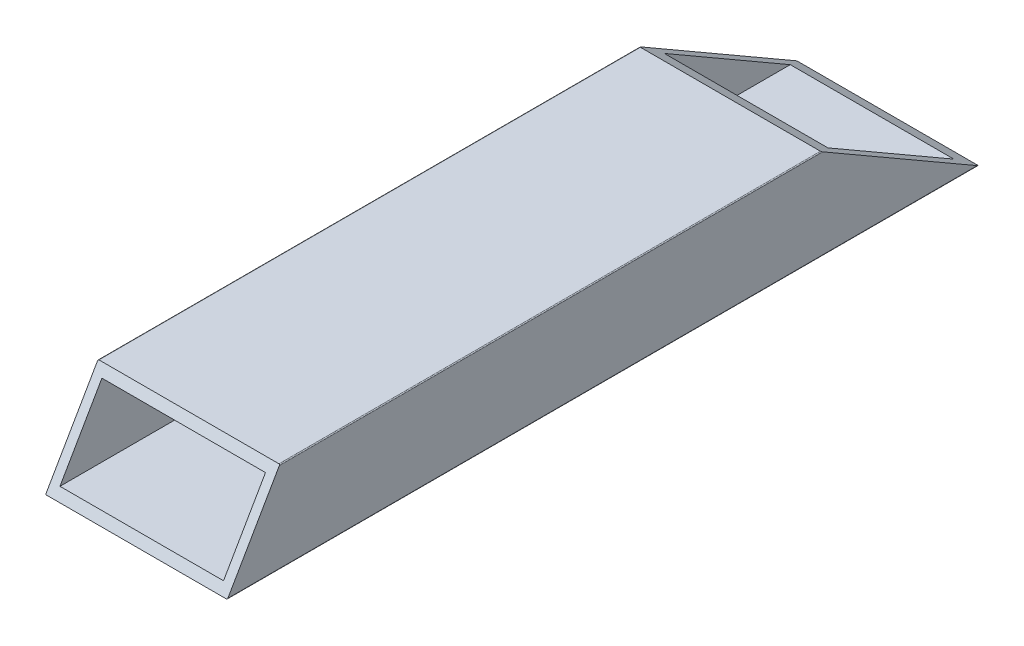
ISO-10303-21;
HEADER;
FILE_DESCRIPTION(('STEP AP214'),'2;1');
FILE_NAME('part.step','',(''),(''),'','','');
FILE_SCHEMA(('AUTOMOTIVE_DESIGN { 1 0 10303 214 1 1 1 1 }'));
ENDSEC;
DATA;
#1=APPLICATION_CONTEXT('core data for automotive mechanical design processes');
#2=APPLICATION_PROTOCOL_DEFINITION('international standard','automotive_design',2000,#1);
#3=PRODUCT_CONTEXT('',#1,'mechanical');
#4=PRODUCT('Part','Part','',(#3));
#5=PRODUCT_RELATED_PRODUCT_CATEGORY('part','',(#4));
#6=PRODUCT_DEFINITION_FORMATION('','',#4);
#7=PRODUCT_DEFINITION_CONTEXT('part definition',#1,'design');
#8=PRODUCT_DEFINITION('design','',#6,#7);
#9=PRODUCT_DEFINITION_SHAPE('','',#8);
#10=(LENGTH_UNIT() NAMED_UNIT(*) SI_UNIT(.MILLI.,.METRE.));
#11=(NAMED_UNIT(*) PLANE_ANGLE_UNIT() SI_UNIT($,.RADIAN.));
#12=(NAMED_UNIT(*) SI_UNIT($,.STERADIAN.) SOLID_ANGLE_UNIT());
#13=UNCERTAINTY_MEASURE_WITH_UNIT(LENGTH_MEASURE(1.E-05),#10,'distance_accuracy_value','');
#14=(GEOMETRIC_REPRESENTATION_CONTEXT(3) GLOBAL_UNCERTAINTY_ASSIGNED_CONTEXT((#13)) GLOBAL_UNIT_ASSIGNED_CONTEXT((#10,
#11,#12)) REPRESENTATION_CONTEXT('',''));
#15=CARTESIAN_POINT('',(0.,0.,0.));
#16=DIRECTION('',(0.,0.,1.));
#17=DIRECTION('',(1.,0.,0.));
#18=AXIS2_PLACEMENT_3D('',#15,#16,#17);
#19=CARTESIAN_POINT('',(2.,18.,165.35));
#20=DIRECTION('',(0.,-1.,0.));
#21=DIRECTION('',(0.,0.,-1.));
#22=AXIS2_PLACEMENT_3D('',#19,#20,#21);
#23=PLANE('',#22);
#24=DIRECTION('',(1.,0.,0.));
#25=VECTOR('',#24,1.);
#26=CARTESIAN_POINT('',(2.,18.,154.957695154587));
#27=LINE('',#26,#25);
#28=CARTESIAN_POINT('',(2.,18.,154.957695154587));
#29=VERTEX_POINT('',#28);
#30=CARTESIAN_POINT('',(38.,18.,154.957695154587));
#31=VERTEX_POINT('',#30);
#32=EDGE_CURVE('E11',#29,#31,#27,.T.);
#33=ORIENTED_EDGE('',*,*,#32,.F.);
#34=DIRECTION('',(0.,0.,-1.));
#35=VECTOR('',#34,1.);
#36=CARTESIAN_POINT('',(2.,18.,165.35));
#37=LINE('',#36,#35);
#38=CARTESIAN_POINT('',(2.,18.,31.1769145362402));
#39=VERTEX_POINT('',#38);
#40=EDGE_CURVE('E170',#29,#39,#37,.T.);
#41=ORIENTED_EDGE('',*,*,#40,.T.);
#42=DIRECTION('',(-1.,0.,0.));
#43=VECTOR('',#42,1.);
#44=CARTESIAN_POINT('',(1.99999999999992,18.,31.1769145362402));
#45=LINE('',#44,#43);
#46=CARTESIAN_POINT('',(38.,18.,31.1769145362402));
#47=VERTEX_POINT('',#46);
#48=EDGE_CURVE('E44',#47,#39,#45,.T.);
#49=ORIENTED_EDGE('',*,*,#48,.F.);
#50=DIRECTION('',(0.,0.,-1.));
#51=VECTOR('',#50,1.);
#52=CARTESIAN_POINT('',(38.,18.,165.35));
#53=LINE('',#52,#51);
#54=EDGE_CURVE('E176',#31,#47,#53,.T.);
#55=ORIENTED_EDGE('',*,*,#54,.F.);
#56=EDGE_LOOP('',(#33,#41,#49,#55));
#57=FACE_BOUND('',#56,.T.);
#58=ADVANCED_FACE('F36',(#57),#23,.T.);
#59=CARTESIAN_POINT('',(38.,2.,165.35));
#60=DIRECTION('',(-1.,0.,0.));
#61=DIRECTION('',(0.,0.,1.));
#62=AXIS2_PLACEMENT_3D('',#59,#60,#61);
#63=PLANE('',#62);
#64=DIRECTION('',(0.,-0.866025403784436,0.500000000000004));
#65=VECTOR('',#64,1.);
#66=CARTESIAN_POINT('',(38.,1.5,164.483974596216));
#67=LINE('',#66,#65);
#68=CARTESIAN_POINT('',(38.,2.,164.195299461621));
#69=VERTEX_POINT('',#68);
#70=EDGE_CURVE('E229',#31,#69,#67,.T.);
#71=ORIENTED_EDGE('',*,*,#70,.F.);
#72=ORIENTED_EDGE('',*,*,#54,.T.);
#73=DIRECTION('',(0.,0.499999999999995,0.866025403784442));
#74=VECTOR('',#73,1.);
#75=CARTESIAN_POINT('',(38.,72.098650257878,124.878525403785));
#76=LINE('',#75,#74);
#77=CARTESIAN_POINT('',(38.,2.,3.46410161513773));
#78=VERTEX_POINT('',#77);
#79=EDGE_CURVE('E160',#78,#47,#76,.T.);
#80=ORIENTED_EDGE('',*,*,#79,.F.);
#81=DIRECTION('',(0.,0.,-1.));
#82=VECTOR('',#81,1.);
#83=CARTESIAN_POINT('',(38.,2.,165.35));
#84=LINE('',#83,#82);
#85=EDGE_CURVE('E179',#69,#78,#84,.T.);
#86=ORIENTED_EDGE('',*,*,#85,.F.);
#87=EDGE_LOOP('',(#71,#72,#80,#86));
#88=FACE_BOUND('',#87,.T.);
#89=ADVANCED_FACE('F257',(#88),#63,.T.);
#90=CARTESIAN_POINT('',(2.,2.,165.35));
#91=DIRECTION('',(0.,1.,0.));
#92=DIRECTION('',(0.,0.,1.));
#93=AXIS2_PLACEMENT_3D('',#90,#91,#92);
#94=PLANE('',#93);
#95=DIRECTION('',(-1.,0.,0.));
#96=VECTOR('',#95,1.);
#97=CARTESIAN_POINT('',(2.,2.,164.195299461621));
#98=LINE('',#97,#96);
#99=CARTESIAN_POINT('',(2.,2.,164.195299461621));
#100=VERTEX_POINT('',#99);
#101=EDGE_CURVE('E231',#69,#100,#98,.T.);
#102=ORIENTED_EDGE('',*,*,#101,.F.);
#103=ORIENTED_EDGE('',*,*,#85,.T.);
#104=DIRECTION('',(1.,0.,0.));
#105=VECTOR('',#104,1.);
#106=CARTESIAN_POINT('',(1.9999999999999,2.,3.46410161513777));
#107=LINE('',#106,#105);
#108=CARTESIAN_POINT('',(2.,2.,3.46410161513777));
#109=VERTEX_POINT('',#108);
#110=EDGE_CURVE('E173',#109,#78,#107,.T.);
#111=ORIENTED_EDGE('',*,*,#110,.F.);
#112=DIRECTION('',(0.,0.,-1.));
#113=VECTOR('',#112,1.);
#114=CARTESIAN_POINT('',(2.,2.,165.35));
#115=LINE('',#114,#113);
#116=EDGE_CURVE('E143',#100,#109,#115,.T.);
#117=ORIENTED_EDGE('',*,*,#116,.F.);
#118=EDGE_LOOP('',(#102,#103,#111,#117));
#119=FACE_BOUND('',#118,.T.);
#120=ADVANCED_FACE('F262',(#119),#94,.T.);
#121=CARTESIAN_POINT('',(2.,2.,165.35));
#122=DIRECTION('',(1.,0.,0.));
#123=DIRECTION('',(0.,0.,-1.));
#124=AXIS2_PLACEMENT_3D('',#121,#122,#123);
#125=PLANE('',#124);
#126=DIRECTION('',(0.,0.866025403784436,-0.500000000000004));
#127=VECTOR('',#126,1.);
#128=CARTESIAN_POINT('',(2.,1.49999999999999,164.483974596216));
#129=LINE('',#128,#127);
#130=EDGE_CURVE('E233',#100,#29,#129,.T.);
#131=ORIENTED_EDGE('',*,*,#130,.F.);
#132=ORIENTED_EDGE('',*,*,#116,.T.);
#133=DIRECTION('',(0.,-0.499999999999995,-0.866025403784442));
#134=VECTOR('',#133,1.);
#135=CARTESIAN_POINT('',(2.,72.098650257878,124.878525403785));
#136=LINE('',#135,#134);
#137=EDGE_CURVE('E157',#39,#109,#136,.T.);
#138=ORIENTED_EDGE('',*,*,#137,.F.);
#139=ORIENTED_EDGE('',*,*,#40,.F.);
#140=EDGE_LOOP('',(#131,#132,#138,#139));
#141=FACE_BOUND('',#140,.T.);
#142=ADVANCED_FACE('F169',(#141),#125,.T.);
#143=CARTESIAN_POINT('',(40.,20.,34.641016151378));
#144=DIRECTION('',(0.,-0.866025403784442,0.499999999999995));
#145=DIRECTION('',(0.,-0.499999999999995,-0.866025403784442));
#146=AXIS2_PLACEMENT_3D('',#143,#144,#145);
#147=PLANE('',#146);
#148=ORIENTED_EDGE('',*,*,#137,.T.);
#149=ORIENTED_EDGE('',*,*,#110,.T.);
#150=ORIENTED_EDGE('',*,*,#79,.T.);
#151=ORIENTED_EDGE('',*,*,#48,.T.);
#152=EDGE_LOOP('',(#148,#149,#150,#151));
#153=FACE_BOUND('',#152,.T.);
#154=DIRECTION('',(0.,0.499999999999995,0.866025403784441));
#155=VECTOR('',#154,1.);
#156=CARTESIAN_POINT('',(0.,20.,34.641016151378));
#157=LINE('',#156,#155);
#158=CARTESIAN_POINT('',(0.,0.20000000000001,0.346410161513773));
#159=VERTEX_POINT('',#158);
#160=CARTESIAN_POINT('',(0.,19.8,34.2946059898642));
#161=VERTEX_POINT('',#160);
#162=EDGE_CURVE('E213',#159,#161,#157,.T.);
#163=ORIENTED_EDGE('',*,*,#162,.T.);
#164=CARTESIAN_POINT('',(0.2,19.8,34.2946059898642));
#165=DIRECTION('',(0.,-0.866025403784442,0.499999999999995));
#166=DIRECTION('',(0.,-0.499999999999995,-0.866025403784442));
#167=AXIS2_PLACEMENT_3D('',#164,#165,#166);
#168=ELLIPSE('',#167,0.400000000000003,0.199999999999999);
#169=CARTESIAN_POINT('',(0.199999999999999,20.,34.641016151378));
#170=VERTEX_POINT('',#169);
#171=EDGE_CURVE('E172',#170,#161,#168,.T.);
#172=ORIENTED_EDGE('',*,*,#171,.F.);
#173=DIRECTION('',(-1.,0.,0.));
#174=VECTOR('',#173,1.);
#175=CARTESIAN_POINT('',(40.,20.,34.641016151378));
#176=LINE('',#175,#174);
#177=CARTESIAN_POINT('',(39.8,20.,34.641016151378));
#178=VERTEX_POINT('',#177);
#179=EDGE_CURVE('E212',#178,#170,#176,.T.);
#180=ORIENTED_EDGE('',*,*,#179,.F.);
#181=CARTESIAN_POINT('',(39.8,19.8,34.2946059898642));
#182=DIRECTION('',(0.,-0.866025403784442,0.499999999999995));
#183=DIRECTION('',(0.,-0.499999999999995,-0.866025403784442));
#184=AXIS2_PLACEMENT_3D('',#181,#182,#183);
#185=ELLIPSE('',#184,0.400000000000001,0.199999999999999);
#186=CARTESIAN_POINT('',(40.,19.8,34.2946059898642));
#187=VERTEX_POINT('',#186);
#188=EDGE_CURVE('E132',#187,#178,#185,.T.);
#189=ORIENTED_EDGE('',*,*,#188,.F.);
#190=DIRECTION('',(0.,0.499999999999995,0.866025403784441));
#191=VECTOR('',#190,1.);
#192=CARTESIAN_POINT('',(40.,20.,34.641016151378));
#193=LINE('',#192,#191);
#194=CARTESIAN_POINT('',(40.,0.199999999999975,0.346410161513717));
#195=VERTEX_POINT('',#194);
#196=EDGE_CURVE('E127',#195,#187,#193,.T.);
#197=ORIENTED_EDGE('',*,*,#196,.F.);
#198=CARTESIAN_POINT('',(39.8,0.2,0.346410161513738));
#199=DIRECTION('',(0.,-0.866025403784442,0.499999999999995));
#200=DIRECTION('',(0.,-0.499999999999995,-0.866025403784442));
#201=AXIS2_PLACEMENT_3D('',#198,#199,#200);
#202=ELLIPSE('',#201,0.400000000000003,0.199999999999999);
#203=CARTESIAN_POINT('',(39.8,0.,0.));
#204=VERTEX_POINT('',#203);
#205=EDGE_CURVE('E122',#204,#195,#202,.T.);
#206=ORIENTED_EDGE('',*,*,#205,.F.);
#207=DIRECTION('',(1.,0.,0.));
#208=VECTOR('',#207,1.);
#209=CARTESIAN_POINT('',(0.200000000000001,0.,0.));
#210=LINE('',#209,#208);
#211=CARTESIAN_POINT('',(0.199999999999999,0.,0.));
#212=VERTEX_POINT('',#211);
#213=EDGE_CURVE('E125',#212,#204,#210,.T.);
#214=ORIENTED_EDGE('',*,*,#213,.F.);
#215=CARTESIAN_POINT('',(0.2,0.2,0.346410161513766));
#216=DIRECTION('',(0.,-0.866025403784442,0.499999999999995));
#217=DIRECTION('',(0.,-0.499999999999995,-0.866025403784442));
#218=AXIS2_PLACEMENT_3D('',#215,#216,#217);
#219=ELLIPSE('',#218,0.400000000000004,0.2);
#220=EDGE_CURVE('E59',#159,#212,#219,.T.);
#221=ORIENTED_EDGE('',*,*,#220,.F.);
#222=EDGE_LOOP('',(#163,#172,#180,#189,#197,#206,#214,#221));
#223=FACE_BOUND('',#222,.T.);
#224=ADVANCED_FACE('F124',(#153,#223),#147,.F.);
#225=CARTESIAN_POINT('',(40.,0.,165.35));
#226=DIRECTION('',(0.,-0.500000000000004,-0.866025403784436));
#227=DIRECTION('',(0.,0.866025403784436,-0.500000000000004));
#228=AXIS2_PLACEMENT_3D('',#225,#226,#227);
#229=PLANE('',#228);
#230=ORIENTED_EDGE('',*,*,#130,.T.);
#231=ORIENTED_EDGE('',*,*,#32,.T.);
#232=ORIENTED_EDGE('',*,*,#70,.T.);
#233=ORIENTED_EDGE('',*,*,#101,.T.);
#234=EDGE_LOOP('',(#230,#231,#232,#233));
#235=FACE_BOUND('',#234,.T.);
#236=DIRECTION('',(1.,0.,0.));
#237=VECTOR('',#236,1.);
#238=CARTESIAN_POINT('',(0.200000000000001,0.,165.35));
#239=LINE('',#238,#237);
#240=CARTESIAN_POINT('',(0.199999999999999,0.,165.35));
#241=VERTEX_POINT('',#240);
#242=CARTESIAN_POINT('',(39.8,0.,165.35));
#243=VERTEX_POINT('',#242);
#244=EDGE_CURVE('E142',#241,#243,#239,.T.);
#245=ORIENTED_EDGE('',*,*,#244,.T.);
#246=CARTESIAN_POINT('',(39.8,0.2,165.234529946162));
#247=DIRECTION('',(0.,-0.500000000000004,-0.866025403784436));
#248=DIRECTION('',(0.,0.866025403784436,-0.500000000000004));
#249=AXIS2_PLACEMENT_3D('',#246,#247,#248);
#250=ELLIPSE('',#249,0.23094010767585,0.199999999999999);
#251=CARTESIAN_POINT('',(40.,0.199999999999998,165.234529946162));
#252=VERTEX_POINT('',#251);
#253=EDGE_CURVE('E147',#252,#243,#250,.T.);
#254=ORIENTED_EDGE('',*,*,#253,.F.);
#255=DIRECTION('',(0.,-0.866025403784436,0.500000000000004));
#256=VECTOR('',#255,1.);
#257=CARTESIAN_POINT('',(40.,0.,165.35));
#258=LINE('',#257,#256);
#259=CARTESIAN_POINT('',(40.,19.8,153.918464670045));
#260=VERTEX_POINT('',#259);
#261=EDGE_CURVE('E211',#260,#252,#258,.T.);
#262=ORIENTED_EDGE('',*,*,#261,.F.);
#263=CARTESIAN_POINT('',(39.8,19.8,153.918464670045));
#264=DIRECTION('',(0.,-0.500000000000004,-0.866025403784436));
#265=DIRECTION('',(0.,0.866025403784436,-0.500000000000004));
#266=AXIS2_PLACEMENT_3D('',#263,#264,#265);
#267=ELLIPSE('',#266,0.230940107675849,0.199999999999999);
#268=CARTESIAN_POINT('',(39.8,20.,153.802994616207));
#269=VERTEX_POINT('',#268);
#270=EDGE_CURVE('E207',#269,#260,#267,.T.);
#271=ORIENTED_EDGE('',*,*,#270,.F.);
#272=DIRECTION('',(-1.,0.,0.));
#273=VECTOR('',#272,1.);
#274=CARTESIAN_POINT('',(40.,20.,153.802994616207));
#275=LINE('',#274,#273);
#276=CARTESIAN_POINT('',(0.199999999999999,20.,153.802994616207));
#277=VERTEX_POINT('',#276);
#278=EDGE_CURVE('E220',#269,#277,#275,.T.);
#279=ORIENTED_EDGE('',*,*,#278,.T.);
#280=CARTESIAN_POINT('',(0.2,19.8,153.918464670045));
#281=DIRECTION('',(0.,-0.500000000000004,-0.866025403784436));
#282=DIRECTION('',(0.,0.866025403784436,-0.500000000000004));
#283=AXIS2_PLACEMENT_3D('',#280,#281,#282);
#284=ELLIPSE('',#283,0.23094010767585,0.199999999999999);
#285=CARTESIAN_POINT('',(0.,19.8,153.918464670045));
#286=VERTEX_POINT('',#285);
#287=EDGE_CURVE('E51',#286,#277,#284,.T.);
#288=ORIENTED_EDGE('',*,*,#287,.F.);
#289=DIRECTION('',(0.,-0.866025403784436,0.500000000000004));
#290=VECTOR('',#289,1.);
#291=CARTESIAN_POINT('',(0.,0.,165.35));
#292=LINE('',#291,#290);
#293=CARTESIAN_POINT('',(0.,0.200000000000007,165.234529946162));
#294=VERTEX_POINT('',#293);
#295=EDGE_CURVE('E216',#286,#294,#292,.T.);
#296=ORIENTED_EDGE('',*,*,#295,.T.);
#297=CARTESIAN_POINT('',(0.2,0.2,165.234529946162));
#298=DIRECTION('',(0.,-0.500000000000004,-0.866025403784436));
#299=DIRECTION('',(0.,0.866025403784436,-0.500000000000004));
#300=AXIS2_PLACEMENT_3D('',#297,#298,#299);
#301=ELLIPSE('',#300,0.230940107675851,0.2);
#302=EDGE_CURVE('E177',#241,#294,#301,.T.);
#303=ORIENTED_EDGE('',*,*,#302,.F.);
#304=EDGE_LOOP('',(#245,#254,#262,#271,#279,#288,#296,#303));
#305=FACE_BOUND('',#304,.T.);
#306=ADVANCED_FACE('F247',(#235,#305),#229,.F.);
#307=CARTESIAN_POINT('',(0.2,0.2,165.35));
#308=DIRECTION('',(0.,0.,-1.));
#309=DIRECTION('',(-1.,0.,0.));
#310=AXIS2_PLACEMENT_3D('',#307,#308,#309);
#311=CYLINDRICAL_SURFACE('',#310,0.2);
#312=DIRECTION('',(0.,0.,-1.));
#313=VECTOR('',#312,1.);
#314=CARTESIAN_POINT('',(0.200000000000001,0.,165.35));
#315=LINE('',#314,#313);
#316=EDGE_CURVE('E141',#241,#212,#315,.T.);
#317=ORIENTED_EDGE('',*,*,#316,.F.);
#318=ORIENTED_EDGE('',*,*,#302,.T.);
#319=DIRECTION('',(0.,0.,-1.));
#320=VECTOR('',#319,1.);
#321=CARTESIAN_POINT('',(0.,0.200000000000001,165.35));
#322=LINE('',#321,#320);
#323=EDGE_CURVE('E188',#294,#159,#322,.T.);
#324=ORIENTED_EDGE('',*,*,#323,.T.);
#325=ORIENTED_EDGE('',*,*,#220,.T.);
#326=EDGE_LOOP('',(#317,#318,#324,#325));
#327=FACE_BOUND('',#326,.T.);
#328=ADVANCED_FACE('F38',(#327),#311,.T.);
#329=CARTESIAN_POINT('',(0.200000000000001,0.,165.35));
#330=DIRECTION('',(0.,1.,0.));
#331=DIRECTION('',(0.,0.,1.));
#332=AXIS2_PLACEMENT_3D('',#329,#330,#331);
#333=PLANE('',#332);
#334=ORIENTED_EDGE('',*,*,#213,.T.);
#335=DIRECTION('',(0.,0.,-1.));
#336=VECTOR('',#335,1.);
#337=CARTESIAN_POINT('',(39.8,0.,165.35));
#338=LINE('',#337,#336);
#339=EDGE_CURVE('E139',#243,#204,#338,.T.);
#340=ORIENTED_EDGE('',*,*,#339,.F.);
#341=ORIENTED_EDGE('',*,*,#244,.F.);
#342=ORIENTED_EDGE('',*,*,#316,.T.);
#343=EDGE_LOOP('',(#334,#340,#341,#342));
#344=FACE_BOUND('',#343,.T.);
#345=ADVANCED_FACE('F137',(#344),#333,.F.);
#346=CARTESIAN_POINT('',(39.8,0.2,165.35));
#347=DIRECTION('',(0.,0.,-1.));
#348=DIRECTION('',(-1.,0.,0.));
#349=AXIS2_PLACEMENT_3D('',#346,#347,#348);
#350=CYLINDRICAL_SURFACE('',#349,0.199999999999999);
#351=DIRECTION('',(0.,0.,-1.));
#352=VECTOR('',#351,1.);
#353=CARTESIAN_POINT('',(40.,0.2,165.35));
#354=LINE('',#353,#352);
#355=EDGE_CURVE('E148',#252,#195,#354,.T.);
#356=ORIENTED_EDGE('',*,*,#355,.F.);
#357=ORIENTED_EDGE('',*,*,#253,.T.);
#358=ORIENTED_EDGE('',*,*,#339,.T.);
#359=ORIENTED_EDGE('',*,*,#205,.T.);
#360=EDGE_LOOP('',(#356,#357,#358,#359));
#361=FACE_BOUND('',#360,.T.);
#362=ADVANCED_FACE('F146',(#361),#350,.T.);
#363=CARTESIAN_POINT('',(40.,0.2,165.35));
#364=DIRECTION('',(-1.,0.,0.));
#365=DIRECTION('',(0.,-1.,0.));
#366=AXIS2_PLACEMENT_3D('',#363,#364,#365);
#367=PLANE('',#366);
#368=DIRECTION('',(0.,0.,-1.));
#369=VECTOR('',#368,1.);
#370=CARTESIAN_POINT('',(40.,19.8,165.35));
#371=LINE('',#370,#369);
#372=EDGE_CURVE('E151',#260,#187,#371,.T.);
#373=ORIENTED_EDGE('',*,*,#372,.F.);
#374=ORIENTED_EDGE('',*,*,#261,.T.);
#375=ORIENTED_EDGE('',*,*,#355,.T.);
#376=ORIENTED_EDGE('',*,*,#196,.T.);
#377=EDGE_LOOP('',(#373,#374,#375,#376));
#378=FACE_BOUND('',#377,.T.);
#379=ADVANCED_FACE('F210',(#378),#367,.F.);
#380=CARTESIAN_POINT('',(39.8,19.8,165.35));
#381=DIRECTION('',(0.,0.,-1.));
#382=DIRECTION('',(-1.,0.,0.));
#383=AXIS2_PLACEMENT_3D('',#380,#381,#382);
#384=CYLINDRICAL_SURFACE('',#383,0.199999999999999);
#385=DIRECTION('',(0.,0.,-1.));
#386=VECTOR('',#385,1.);
#387=CARTESIAN_POINT('',(39.8,20.,165.35));
#388=LINE('',#387,#386);
#389=EDGE_CURVE('E198',#269,#178,#388,.T.);
#390=ORIENTED_EDGE('',*,*,#389,.F.);
#391=ORIENTED_EDGE('',*,*,#270,.T.);
#392=ORIENTED_EDGE('',*,*,#372,.T.);
#393=ORIENTED_EDGE('',*,*,#188,.T.);
#394=EDGE_LOOP('',(#390,#391,#392,#393));
#395=FACE_BOUND('',#394,.T.);
#396=ADVANCED_FACE('F206',(#395),#384,.T.);
#397=CARTESIAN_POINT('',(0.2,20.,165.35));
#398=DIRECTION('',(0.,-1.,0.));
#399=DIRECTION('',(0.,0.,-1.));
#400=AXIS2_PLACEMENT_3D('',#397,#398,#399);
#401=PLANE('',#400);
#402=DIRECTION('',(0.,0.,-1.));
#403=VECTOR('',#402,1.);
#404=CARTESIAN_POINT('',(0.2,20.,165.35));
#405=LINE('',#404,#403);
#406=EDGE_CURVE('E195',#277,#170,#405,.T.);
#407=ORIENTED_EDGE('',*,*,#406,.F.);
#408=ORIENTED_EDGE('',*,*,#278,.F.);
#409=ORIENTED_EDGE('',*,*,#389,.T.);
#410=ORIENTED_EDGE('',*,*,#179,.T.);
#411=EDGE_LOOP('',(#407,#408,#409,#410));
#412=FACE_BOUND('',#411,.T.);
#413=ADVANCED_FACE('F242',(#412),#401,.F.);
#414=CARTESIAN_POINT('',(0.2,19.8,165.35));
#415=DIRECTION('',(0.,0.,-1.));
#416=DIRECTION('',(-1.,0.,0.));
#417=AXIS2_PLACEMENT_3D('',#414,#415,#416);
#418=CYLINDRICAL_SURFACE('',#417,0.199999999999999);
#419=DIRECTION('',(0.,0.,-1.));
#420=VECTOR('',#419,1.);
#421=CARTESIAN_POINT('',(0.,19.8,165.35));
#422=LINE('',#421,#420);
#423=EDGE_CURVE('E192',#286,#161,#422,.T.);
#424=ORIENTED_EDGE('',*,*,#423,.F.);
#425=ORIENTED_EDGE('',*,*,#287,.T.);
#426=ORIENTED_EDGE('',*,*,#406,.T.);
#427=ORIENTED_EDGE('',*,*,#171,.T.);
#428=EDGE_LOOP('',(#424,#425,#426,#427));
#429=FACE_BOUND('',#428,.T.);
#430=ADVANCED_FACE('F239',(#429),#418,.T.);
#431=CARTESIAN_POINT('',(0.,0.200000000000001,165.35));
#432=DIRECTION('',(1.,0.,0.));
#433=DIRECTION('',(0.,1.,0.));
#434=AXIS2_PLACEMENT_3D('',#431,#432,#433);
#435=PLANE('',#434);
#436=ORIENTED_EDGE('',*,*,#323,.F.);
#437=ORIENTED_EDGE('',*,*,#295,.F.);
#438=ORIENTED_EDGE('',*,*,#423,.T.);
#439=ORIENTED_EDGE('',*,*,#162,.F.);
#440=EDGE_LOOP('',(#436,#437,#438,#439));
#441=FACE_BOUND('',#440,.T.);
#442=ADVANCED_FACE('F245',(#441),#435,.F.);
#443=CLOSED_SHELL('',(#58,#89,#120,#142,#224,#306,#328,#345,#362,#379,#396,#413,#430,#442));
#444=MANIFOLD_SOLID_BREP('B2',#443);
#445=ADVANCED_BREP_SHAPE_REPRESENTATION('',(#18,#444),#14);
#446=SHAPE_DEFINITION_REPRESENTATION(#9,#445);
ENDSEC;
END-ISO-10303-21;
